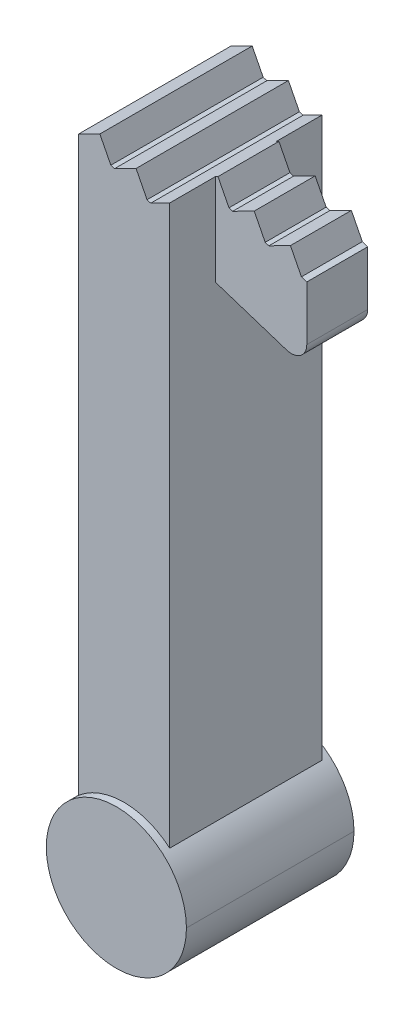
ISO-10303-21;
HEADER;
FILE_DESCRIPTION(('STEP AP214'),'2;1');
FILE_NAME('part.step','',(''),(''),'','','');
FILE_SCHEMA(('AUTOMOTIVE_DESIGN { 1 0 10303 214 1 1 1 1 }'));
ENDSEC;
DATA;
#1=APPLICATION_CONTEXT('core data for automotive mechanical design processes');
#2=APPLICATION_PROTOCOL_DEFINITION('international standard','automotive_design',2000,#1);
#3=PRODUCT_CONTEXT('',#1,'mechanical');
#4=PRODUCT('Part','Part','',(#3));
#5=PRODUCT_RELATED_PRODUCT_CATEGORY('part','',(#4));
#6=PRODUCT_DEFINITION_FORMATION('','',#4);
#7=PRODUCT_DEFINITION_CONTEXT('part definition',#1,'design');
#8=PRODUCT_DEFINITION('design','',#6,#7);
#9=PRODUCT_DEFINITION_SHAPE('','',#8);
#10=(LENGTH_UNIT() NAMED_UNIT(*) SI_UNIT(.MILLI.,.METRE.));
#11=(NAMED_UNIT(*) PLANE_ANGLE_UNIT() SI_UNIT($,.RADIAN.));
#12=(NAMED_UNIT(*) SI_UNIT($,.STERADIAN.) SOLID_ANGLE_UNIT());
#13=UNCERTAINTY_MEASURE_WITH_UNIT(LENGTH_MEASURE(1.E-05),#10,'distance_accuracy_value','');
#14=(GEOMETRIC_REPRESENTATION_CONTEXT(3) GLOBAL_UNCERTAINTY_ASSIGNED_CONTEXT((#13)) GLOBAL_UNIT_ASSIGNED_CONTEXT((#10,
#11,#12)) REPRESENTATION_CONTEXT('',''));
#15=CARTESIAN_POINT('',(0.,0.,0.));
#16=DIRECTION('',(0.,0.,1.));
#17=DIRECTION('',(1.,0.,0.));
#18=AXIS2_PLACEMENT_3D('',#15,#16,#17);
#19=CARTESIAN_POINT('',(-0.74999461407873,10.269587078627,1.25));
#20=DIRECTION('',(1.,0.,0.));
#21=DIRECTION('',(0.,0.,-1.));
#22=AXIS2_PLACEMENT_3D('',#19,#20,#21);
#23=PLANE('',#22);
#24=DIRECTION('',(0.,0.,-1.));
#25=VECTOR('',#24,1.);
#26=CARTESIAN_POINT('',(-0.74999461407873,0.871784422235736,1.375));
#27=LINE('',#26,#25);
#28=CARTESIAN_POINT('',(-0.74999461407873,0.871784422235736,1.25));
#29=VERTEX_POINT('',#28);
#30=CARTESIAN_POINT('',(-0.74999461407873,0.871784422235736,-1.25));
#31=VERTEX_POINT('',#30);
#32=EDGE_CURVE('E11',#29,#31,#27,.T.);
#33=ORIENTED_EDGE('',*,*,#32,.F.);
#34=DIRECTION('',(0.,-1.,0.));
#35=VECTOR('',#34,1.);
#36=CARTESIAN_POINT('',(-0.74999461407873,10.269587078627,1.25));
#37=LINE('',#36,#35);
#38=CARTESIAN_POINT('',(-0.74999461407873,10.269587078627,1.25));
#39=VERTEX_POINT('',#38);
#40=EDGE_CURVE('E25',#39,#29,#37,.T.);
#41=ORIENTED_EDGE('',*,*,#40,.F.);
#42=DIRECTION('',(0.,0.,-1.));
#43=VECTOR('',#42,1.);
#44=CARTESIAN_POINT('',(-0.74999461407873,10.269587078627,1.25));
#45=LINE('',#44,#43);
#46=CARTESIAN_POINT('',(-0.74999461407873,10.269587078627,-1.25));
#47=VERTEX_POINT('',#46);
#48=EDGE_CURVE('E514',#39,#47,#45,.T.);
#49=ORIENTED_EDGE('',*,*,#48,.T.);
#50=DIRECTION('',(0.,-1.,0.));
#51=VECTOR('',#50,1.);
#52=CARTESIAN_POINT('',(-0.74999461407873,10.269587078627,-1.25));
#53=LINE('',#52,#51);
#54=EDGE_CURVE('E510',#47,#31,#53,.T.);
#55=ORIENTED_EDGE('',*,*,#54,.T.);
#56=EDGE_LOOP('',(#33,#41,#49,#55));
#57=FACE_BOUND('',#56,.T.);
#58=ADVANCED_FACE('F17',(#57),#23,.F.);
#59=CARTESIAN_POINT('',(1.99600503402994,8.40399979157656,-1.25));
#60=DIRECTION('',(0.,0.,1.));
#61=DIRECTION('',(1.,0.,0.));
#62=AXIS2_PLACEMENT_3D('',#59,#60,#61);
#63=PLANE('',#62);
#64=CARTESIAN_POINT('',(0.,0.,-1.25));
#65=DIRECTION('',(0.,0.,1.));
#66=DIRECTION('',(1.,0.,0.));
#67=AXIS2_PLACEMENT_3D('',#64,#65,#66);
#68=CIRCLE('',#67,1.15);
#69=CARTESIAN_POINT('',(0.75000502407873,0.871775466422784,-1.25));
#70=VERTEX_POINT('',#69);
#71=EDGE_CURVE('E505',#70,#31,#68,.T.);
#72=ORIENTED_EDGE('',*,*,#71,.T.);
#73=ORIENTED_EDGE('',*,*,#54,.F.);
#74=DIRECTION('',(-0.891006519929732,-0.45399050809759,0.));
#75=VECTOR('',#74,1.);
#76=CARTESIAN_POINT('',(-0.39591414251194,10.450000094243,-1.25));
#77=LINE('',#76,#75);
#78=CARTESIAN_POINT('',(-0.39591414251194,10.450000094243,-1.25));
#79=VERTEX_POINT('',#78);
#80=EDGE_CURVE('E500',#79,#47,#77,.T.);
#81=ORIENTED_EDGE('',*,*,#80,.F.);
#82=DIRECTION('',(-0.453990528946277,0.891006509306795,0.));
#83=VECTOR('',#82,1.);
#84=CARTESIAN_POINT('',(-0.21550111665998,10.095919623069,-1.25));
#85=LINE('',#84,#83);
#86=CARTESIAN_POINT('',(-0.21550111665998,10.095919623069,-1.25));
#87=VERTEX_POINT('',#86);
#88=EDGE_CURVE('E495',#87,#79,#85,.T.);
#89=ORIENTED_EDGE('',*,*,#88,.F.);
#90=DIRECTION('',(-0.951055287303401,0.30902077679704,0.));
#91=VECTOR('',#90,1.);
#92=CARTESIAN_POINT('',(-0.15558447497887,10.076451262604,-1.25));
#93=LINE('',#92,#91);
#94=CARTESIAN_POINT('',(-0.15558447497887,10.076451262604,-1.25));
#95=VERTEX_POINT('',#94);
#96=EDGE_CURVE('E490',#95,#87,#93,.T.);
#97=ORIENTED_EDGE('',*,*,#96,.F.);
#98=DIRECTION('',(-0.891006519929738,-0.453990508097579,0.));
#99=VECTOR('',#98,1.);
#100=CARTESIAN_POINT('',(0.19849599658793,10.25686427822,-1.25));
#101=LINE('',#100,#99);
#102=CARTESIAN_POINT('',(0.19849599658793,10.25686427822,-1.25));
#103=VERTEX_POINT('',#102);
#104=EDGE_CURVE('E485',#103,#95,#101,.T.);
#105=ORIENTED_EDGE('',*,*,#104,.F.);
#106=DIRECTION('',(-0.453990508497482,0.891006519725977,0.));
#107=VECTOR('',#106,1.);
#108=CARTESIAN_POINT('',(0.37890901220366,9.9027838070466,-1.25));
#109=LINE('',#108,#107);
#110=CARTESIAN_POINT('',(0.37890901220366,9.9027838070466,-1.25));
#111=VERTEX_POINT('',#110);
#112=EDGE_CURVE('E480',#111,#103,#109,.T.);
#113=ORIENTED_EDGE('',*,*,#112,.F.);
#114=DIRECTION('',(-0.951059578156974,0.309007570774371,0.));
#115=VECTOR('',#114,1.);
#116=CARTESIAN_POINT('',(0.43882565427848,9.8833163662661,-1.25));
#117=LINE('',#116,#115);
#118=CARTESIAN_POINT('',(0.43882565427848,9.8833163662661,-1.25));
#119=VERTEX_POINT('',#118);
#120=EDGE_CURVE('E475',#119,#111,#117,.T.);
#121=ORIENTED_EDGE('',*,*,#120,.F.);
#122=DIRECTION('',(-0.891006509306383,-0.453990528947086,0.));
#123=VECTOR('',#122,1.);
#124=CARTESIAN_POINT('',(0.79290612545157,10.063729392118,-1.25));
#125=LINE('',#124,#123);
#126=CARTESIAN_POINT('',(0.75000502407873,10.0418701873858,-1.25));
#127=VERTEX_POINT('',#126);
#128=EDGE_CURVE('E470',#127,#119,#125,.T.);
#129=ORIENTED_EDGE('',*,*,#128,.F.);
#130=DIRECTION('',(0.,1.,0.));
#131=VECTOR('',#130,1.);
#132=CARTESIAN_POINT('',(0.75000502407873,0.,-1.25));
#133=LINE('',#132,#131);
#134=EDGE_CURVE('E465',#70,#127,#133,.T.);
#135=ORIENTED_EDGE('',*,*,#134,.F.);
#136=EDGE_LOOP('',(#72,#73,#81,#89,#97,#105,#113,#121,#129,#135));
#137=FACE_BOUND('',#136,.T.);
#138=ADVANCED_FACE('F562',(#137),#63,.F.);
#139=CARTESIAN_POINT('',(0.75000502407873,0.,1.25));
#140=DIRECTION('',(-1.,0.,0.));
#141=DIRECTION('',(0.,0.,1.));
#142=AXIS2_PLACEMENT_3D('',#139,#140,#141);
#143=PLANE('',#142);
#144=DIRECTION('',(0.,0.,-1.));
#145=VECTOR('',#144,1.);
#146=CARTESIAN_POINT('',(0.75000502407873,0.871775466422784,1.375));
#147=LINE('',#146,#145);
#148=CARTESIAN_POINT('',(0.75000502407873,0.871775466422784,1.25));
#149=VERTEX_POINT('',#148);
#150=EDGE_CURVE('E460',#149,#70,#147,.T.);
#151=ORIENTED_EDGE('',*,*,#150,.T.);
#152=ORIENTED_EDGE('',*,*,#134,.T.);
#153=DIRECTION('',(0.,0.,1.));
#154=VECTOR('',#153,1.);
#155=CARTESIAN_POINT('',(0.75000502407873,10.0418701873858,1.25));
#156=LINE('',#155,#154);
#157=CARTESIAN_POINT('',(0.75000502407873,10.0418701873858,-0.5));
#158=VERTEX_POINT('',#157);
#159=EDGE_CURVE('E456',#127,#158,#156,.T.);
#160=ORIENTED_EDGE('',*,*,#159,.T.);
#161=DIRECTION('',(0.,-1.,0.));
#162=VECTOR('',#161,1.);
#163=CARTESIAN_POINT('',(0.75000502407873,12.,-0.5));
#164=LINE('',#163,#162);
#165=CARTESIAN_POINT('',(0.75000502407873,8.5417791450538,-0.5));
#166=VERTEX_POINT('',#165);
#167=EDGE_CURVE('E452',#158,#166,#164,.T.);
#168=ORIENTED_EDGE('',*,*,#167,.T.);
#169=DIRECTION('',(0.,0.,-1.));
#170=VECTOR('',#169,1.);
#171=CARTESIAN_POINT('',(0.75000502407873,8.5417791450538,1.25));
#172=LINE('',#171,#170);
#173=CARTESIAN_POINT('',(0.75000502407873,8.5417791450538,0.5));
#174=VERTEX_POINT('',#173);
#175=EDGE_CURVE('E447',#174,#166,#172,.T.);
#176=ORIENTED_EDGE('',*,*,#175,.F.);
#177=DIRECTION('',(0.,1.,0.));
#178=VECTOR('',#177,1.);
#179=CARTESIAN_POINT('',(0.75000502407873,7.,0.5));
#180=LINE('',#179,#178);
#181=CARTESIAN_POINT('',(0.75000502407873,10.0418701873858,0.5));
#182=VERTEX_POINT('',#181);
#183=EDGE_CURVE('E443',#174,#182,#180,.T.);
#184=ORIENTED_EDGE('',*,*,#183,.T.);
#185=DIRECTION('',(0.,0.,1.));
#186=VECTOR('',#185,1.);
#187=CARTESIAN_POINT('',(0.75000502407873,10.0418701873858,1.25));
#188=LINE('',#187,#186);
#189=CARTESIAN_POINT('',(0.75000502407873,10.0418701873858,1.25));
#190=VERTEX_POINT('',#189);
#191=EDGE_CURVE('E439',#182,#190,#188,.T.);
#192=ORIENTED_EDGE('',*,*,#191,.T.);
#193=DIRECTION('',(0.,1.,0.));
#194=VECTOR('',#193,1.);
#195=CARTESIAN_POINT('',(0.75000502407873,0.,1.25));
#196=LINE('',#195,#194);
#197=EDGE_CURVE('E434',#149,#190,#196,.T.);
#198=ORIENTED_EDGE('',*,*,#197,.F.);
#199=EDGE_LOOP('',(#151,#152,#160,#168,#176,#184,#192,#198));
#200=FACE_BOUND('',#199,.T.);
#201=ADVANCED_FACE('F530',(#200),#143,.F.);
#202=CARTESIAN_POINT('',(1.99600503402994,8.40399979157656,1.25));
#203=DIRECTION('',(0.,0.,1.));
#204=DIRECTION('',(1.,0.,0.));
#205=AXIS2_PLACEMENT_3D('',#202,#203,#204);
#206=PLANE('',#205);
#207=ORIENTED_EDGE('',*,*,#40,.T.);
#208=CARTESIAN_POINT('',(0.,0.,1.25));
#209=DIRECTION('',(0.,0.,1.));
#210=DIRECTION('',(1.,0.,0.));
#211=AXIS2_PLACEMENT_3D('',#208,#209,#210);
#212=CIRCLE('',#211,1.15);
#213=EDGE_CURVE('E429',#149,#29,#212,.T.);
#214=ORIENTED_EDGE('',*,*,#213,.F.);
#215=ORIENTED_EDGE('',*,*,#197,.T.);
#216=DIRECTION('',(-0.891006509306383,-0.453990528947086,0.));
#217=VECTOR('',#216,1.);
#218=CARTESIAN_POINT('',(0.79290612545157,10.063729392118,1.25));
#219=LINE('',#218,#217);
#220=CARTESIAN_POINT('',(0.43882565427848,9.8833163662661,1.25));
#221=VERTEX_POINT('',#220);
#222=EDGE_CURVE('E425',#190,#221,#219,.T.);
#223=ORIENTED_EDGE('',*,*,#222,.T.);
#224=DIRECTION('',(-0.951059578156974,0.309007570774371,0.));
#225=VECTOR('',#224,1.);
#226=CARTESIAN_POINT('',(0.43882565427848,9.8833163662661,1.25));
#227=LINE('',#226,#225);
#228=CARTESIAN_POINT('',(0.37890901220366,9.9027838070466,1.25));
#229=VERTEX_POINT('',#228);
#230=EDGE_CURVE('E421',#221,#229,#227,.T.);
#231=ORIENTED_EDGE('',*,*,#230,.T.);
#232=DIRECTION('',(-0.453990508497482,0.891006519725977,0.));
#233=VECTOR('',#232,1.);
#234=CARTESIAN_POINT('',(0.37890901220366,9.9027838070466,1.25));
#235=LINE('',#234,#233);
#236=CARTESIAN_POINT('',(0.19849599658793,10.25686427822,1.25));
#237=VERTEX_POINT('',#236);
#238=EDGE_CURVE('E417',#229,#237,#235,.T.);
#239=ORIENTED_EDGE('',*,*,#238,.T.);
#240=DIRECTION('',(-0.891006519929738,-0.453990508097579,0.));
#241=VECTOR('',#240,1.);
#242=CARTESIAN_POINT('',(0.19849599658793,10.25686427822,1.25));
#243=LINE('',#242,#241);
#244=CARTESIAN_POINT('',(-0.15558447497887,10.076451262604,1.25));
#245=VERTEX_POINT('',#244);
#246=EDGE_CURVE('E413',#237,#245,#243,.T.);
#247=ORIENTED_EDGE('',*,*,#246,.T.);
#248=DIRECTION('',(-0.951055287303401,0.30902077679704,0.));
#249=VECTOR('',#248,1.);
#250=CARTESIAN_POINT('',(-0.15558447497887,10.076451262604,1.25));
#251=LINE('',#250,#249);
#252=CARTESIAN_POINT('',(-0.21550111665998,10.095919623069,1.25));
#253=VERTEX_POINT('',#252);
#254=EDGE_CURVE('E409',#245,#253,#251,.T.);
#255=ORIENTED_EDGE('',*,*,#254,.T.);
#256=DIRECTION('',(-0.453990528946277,0.891006509306795,0.));
#257=VECTOR('',#256,1.);
#258=CARTESIAN_POINT('',(-0.21550111665998,10.095919623069,1.25));
#259=LINE('',#258,#257);
#260=CARTESIAN_POINT('',(-0.39591414251194,10.450000094243,1.25));
#261=VERTEX_POINT('',#260);
#262=EDGE_CURVE('E405',#253,#261,#259,.T.);
#263=ORIENTED_EDGE('',*,*,#262,.T.);
#264=DIRECTION('',(-0.891006519929732,-0.45399050809759,0.));
#265=VECTOR('',#264,1.);
#266=CARTESIAN_POINT('',(-0.39591414251194,10.450000094243,1.25));
#267=LINE('',#266,#265);
#268=EDGE_CURVE('E401',#261,#39,#267,.T.);
#269=ORIENTED_EDGE('',*,*,#268,.T.);
#270=EDGE_LOOP('',(#207,#214,#215,#223,#231,#239,#247,#255,#263,#269));
#271=FACE_BOUND('',#270,.T.);
#272=ADVANCED_FACE('F524',(#271),#206,.T.);
#273=CARTESIAN_POINT('',(-0.39591414251194,10.450000094243,1.25));
#274=DIRECTION('',(0.45399050809759,-0.891006519929732,0.));
#275=DIRECTION('',(0.891006519929732,0.45399050809759,0.));
#276=AXIS2_PLACEMENT_3D('',#273,#274,#275);
#277=PLANE('',#276);
#278=ORIENTED_EDGE('',*,*,#80,.T.);
#279=ORIENTED_EDGE('',*,*,#48,.F.);
#280=ORIENTED_EDGE('',*,*,#268,.F.);
#281=DIRECTION('',(0.,0.,-1.));
#282=VECTOR('',#281,1.);
#283=CARTESIAN_POINT('',(-0.39591414251194,10.450000094243,1.25));
#284=LINE('',#283,#282);
#285=EDGE_CURVE('E396',#261,#79,#284,.T.);
#286=ORIENTED_EDGE('',*,*,#285,.T.);
#287=EDGE_LOOP('',(#278,#279,#280,#286));
#288=FACE_BOUND('',#287,.T.);
#289=ADVANCED_FACE('F559',(#288),#277,.F.);
#290=CARTESIAN_POINT('',(-0.21550111665998,10.095919623069,1.25));
#291=DIRECTION('',(-0.891006509306795,-0.453990528946277,0.));
#292=DIRECTION('',(0.453990528946277,-0.891006509306795,0.));
#293=AXIS2_PLACEMENT_3D('',#290,#291,#292);
#294=PLANE('',#293);
#295=ORIENTED_EDGE('',*,*,#88,.T.);
#296=ORIENTED_EDGE('',*,*,#285,.F.);
#297=ORIENTED_EDGE('',*,*,#262,.F.);
#298=DIRECTION('',(0.,0.,-1.));
#299=VECTOR('',#298,1.);
#300=CARTESIAN_POINT('',(-0.21550111665998,10.095919623069,1.25));
#301=LINE('',#300,#299);
#302=EDGE_CURVE('E391',#253,#87,#301,.T.);
#303=ORIENTED_EDGE('',*,*,#302,.T.);
#304=EDGE_LOOP('',(#295,#296,#297,#303));
#305=FACE_BOUND('',#304,.T.);
#306=ADVANCED_FACE('F556',(#305),#294,.F.);
#307=CARTESIAN_POINT('',(-0.15558447497887,10.076451262604,1.25));
#308=DIRECTION('',(-0.30902077679704,-0.951055287303401,0.));
#309=DIRECTION('',(0.951055287303401,-0.30902077679704,0.));
#310=AXIS2_PLACEMENT_3D('',#307,#308,#309);
#311=PLANE('',#310);
#312=ORIENTED_EDGE('',*,*,#96,.T.);
#313=ORIENTED_EDGE('',*,*,#302,.F.);
#314=ORIENTED_EDGE('',*,*,#254,.F.);
#315=DIRECTION('',(0.,0.,-1.));
#316=VECTOR('',#315,1.);
#317=CARTESIAN_POINT('',(-0.15558447497887,10.076451262604,1.25));
#318=LINE('',#317,#316);
#319=EDGE_CURVE('E386',#245,#95,#318,.T.);
#320=ORIENTED_EDGE('',*,*,#319,.T.);
#321=EDGE_LOOP('',(#312,#313,#314,#320));
#322=FACE_BOUND('',#321,.T.);
#323=ADVANCED_FACE('F554',(#322),#311,.F.);
#324=CARTESIAN_POINT('',(0.19849599658793,10.25686427822,1.25));
#325=DIRECTION('',(0.453990508097579,-0.891006519929738,0.));
#326=DIRECTION('',(0.891006519929738,0.453990508097579,0.));
#327=AXIS2_PLACEMENT_3D('',#324,#325,#326);
#328=PLANE('',#327);
#329=ORIENTED_EDGE('',*,*,#104,.T.);
#330=ORIENTED_EDGE('',*,*,#319,.F.);
#331=ORIENTED_EDGE('',*,*,#246,.F.);
#332=DIRECTION('',(0.,0.,-1.));
#333=VECTOR('',#332,1.);
#334=CARTESIAN_POINT('',(0.19849599658793,10.25686427822,1.25));
#335=LINE('',#334,#333);
#336=EDGE_CURVE('E381',#237,#103,#335,.T.);
#337=ORIENTED_EDGE('',*,*,#336,.T.);
#338=EDGE_LOOP('',(#329,#330,#331,#337));
#339=FACE_BOUND('',#338,.T.);
#340=ADVANCED_FACE('F548',(#339),#328,.F.);
#341=CARTESIAN_POINT('',(0.37890901220366,9.9027838070466,1.25));
#342=DIRECTION('',(-0.891006519725977,-0.453990508497482,0.));
#343=DIRECTION('',(0.453990508497482,-0.891006519725977,0.));
#344=AXIS2_PLACEMENT_3D('',#341,#342,#343);
#345=PLANE('',#344);
#346=ORIENTED_EDGE('',*,*,#112,.T.);
#347=ORIENTED_EDGE('',*,*,#336,.F.);
#348=ORIENTED_EDGE('',*,*,#238,.F.);
#349=DIRECTION('',(0.,0.,-1.));
#350=VECTOR('',#349,1.);
#351=CARTESIAN_POINT('',(0.37890901220366,9.9027838070466,1.25));
#352=LINE('',#351,#350);
#353=EDGE_CURVE('E376',#229,#111,#352,.T.);
#354=ORIENTED_EDGE('',*,*,#353,.T.);
#355=EDGE_LOOP('',(#346,#347,#348,#354));
#356=FACE_BOUND('',#355,.T.);
#357=ADVANCED_FACE('F546',(#356),#345,.F.);
#358=CARTESIAN_POINT('',(0.43882565427848,9.8833163662661,1.25));
#359=DIRECTION('',(-0.309007570774371,-0.951059578156974,0.));
#360=DIRECTION('',(0.951059578156974,-0.309007570774371,0.));
#361=AXIS2_PLACEMENT_3D('',#358,#359,#360);
#362=PLANE('',#361);
#363=ORIENTED_EDGE('',*,*,#120,.T.);
#364=ORIENTED_EDGE('',*,*,#353,.F.);
#365=ORIENTED_EDGE('',*,*,#230,.F.);
#366=DIRECTION('',(0.,0.,-1.));
#367=VECTOR('',#366,1.);
#368=CARTESIAN_POINT('',(0.43882565427848,9.8833163662661,1.25));
#369=LINE('',#368,#367);
#370=EDGE_CURVE('E371',#221,#119,#369,.T.);
#371=ORIENTED_EDGE('',*,*,#370,.T.);
#372=EDGE_LOOP('',(#363,#364,#365,#371));
#373=FACE_BOUND('',#372,.T.);
#374=ADVANCED_FACE('F540',(#373),#362,.F.);
#375=CARTESIAN_POINT('',(0.79290612545157,10.063729392118,1.25));
#376=DIRECTION('',(0.453990528947086,-0.891006509306383,0.));
#377=DIRECTION('',(0.891006509306383,0.453990528947086,0.));
#378=AXIS2_PLACEMENT_3D('',#375,#376,#377);
#379=PLANE('',#378);
#380=DIRECTION('',(0.891006509306383,0.453990528947086,0.));
#381=VECTOR('',#380,1.);
#382=CARTESIAN_POINT('',(0.79290612545157,10.063729392118,-0.5));
#383=LINE('',#382,#381);
#384=CARTESIAN_POINT('',(0.79290612545157,10.063729392118,-0.5));
#385=VERTEX_POINT('',#384);
#386=EDGE_CURVE('E366',#158,#385,#383,.T.);
#387=ORIENTED_EDGE('',*,*,#386,.F.);
#388=ORIENTED_EDGE('',*,*,#159,.F.);
#389=ORIENTED_EDGE('',*,*,#128,.T.);
#390=ORIENTED_EDGE('',*,*,#370,.F.);
#391=ORIENTED_EDGE('',*,*,#222,.F.);
#392=ORIENTED_EDGE('',*,*,#191,.F.);
#393=DIRECTION('',(-0.891006509306383,-0.453990528947086,0.));
#394=VECTOR('',#393,1.);
#395=CARTESIAN_POINT('',(0.79290612545157,10.063729392118,0.5));
#396=LINE('',#395,#394);
#397=CARTESIAN_POINT('',(0.79290612545157,10.063729392118,0.5));
#398=VERTEX_POINT('',#397);
#399=EDGE_CURVE('E361',#398,#182,#396,.T.);
#400=ORIENTED_EDGE('',*,*,#399,.F.);
#401=DIRECTION('',(0.,0.,-1.));
#402=VECTOR('',#401,1.);
#403=CARTESIAN_POINT('',(0.79290612545157,10.063729392118,1.25));
#404=LINE('',#403,#402);
#405=EDGE_CURVE('E357',#398,#385,#404,.T.);
#406=ORIENTED_EDGE('',*,*,#405,.T.);
#407=EDGE_LOOP('',(#387,#388,#389,#390,#391,#392,#400,#406));
#408=FACE_BOUND('',#407,.T.);
#409=ADVANCED_FACE('F538',(#408),#379,.F.);
#410=CARTESIAN_POINT('',(0.97331915130353,9.70964799063,1.25));
#411=DIRECTION('',(-0.891006991810537,-0.453989581978196,0.));
#412=DIRECTION('',(0.453989581978196,-0.891006991810537,0.));
#413=AXIS2_PLACEMENT_3D('',#410,#411,#412);
#414=PLANE('',#413);
#415=DIRECTION('',(0.453989581978196,-0.891006991810537,0.));
#416=VECTOR('',#415,1.);
#417=CARTESIAN_POINT('',(0.97331915130353,9.70964799063,-0.5));
#418=LINE('',#417,#416);
#419=CARTESIAN_POINT('',(0.97331915130353,9.70964799063,-0.5));
#420=VERTEX_POINT('',#419);
#421=EDGE_CURVE('E352',#385,#420,#418,.T.);
#422=ORIENTED_EDGE('',*,*,#421,.F.);
#423=ORIENTED_EDGE('',*,*,#405,.F.);
#424=DIRECTION('',(-0.453989581978196,0.891006991810537,0.));
#425=VECTOR('',#424,1.);
#426=CARTESIAN_POINT('',(0.97331915130353,9.70964799063,0.5));
#427=LINE('',#426,#425);
#428=CARTESIAN_POINT('',(0.97331915130353,9.70964799063,0.5));
#429=VERTEX_POINT('',#428);
#430=EDGE_CURVE('E347',#429,#398,#427,.T.);
#431=ORIENTED_EDGE('',*,*,#430,.F.);
#432=DIRECTION('',(0.,0.,-1.));
#433=VECTOR('',#432,1.);
#434=CARTESIAN_POINT('',(0.97331915130353,9.70964799063,1.25));
#435=LINE('',#434,#433);
#436=EDGE_CURVE('E343',#429,#420,#435,.T.);
#437=ORIENTED_EDGE('',*,*,#436,.T.);
#438=EDGE_LOOP('',(#422,#423,#431,#437));
#439=FACE_BOUND('',#438,.T.);
#440=ADVANCED_FACE('F587',(#439),#414,.F.);
#441=CARTESIAN_POINT('',(1.0332357831421,9.6901805502432,1.25));
#442=DIRECTION('',(-0.309007612872392,-0.951059564478958,0.));
#443=DIRECTION('',(0.951059564478958,-0.309007612872392,0.));
#444=AXIS2_PLACEMENT_3D('',#441,#442,#443);
#445=PLANE('',#444);
#446=DIRECTION('',(0.951059564478958,-0.309007612872392,0.));
#447=VECTOR('',#446,1.);
#448=CARTESIAN_POINT('',(1.0332357831421,9.6901805502432,-0.5));
#449=LINE('',#448,#447);
#450=CARTESIAN_POINT('',(1.0332357831421,9.6901805502432,-0.5));
#451=VERTEX_POINT('',#450);
#452=EDGE_CURVE('E338',#420,#451,#449,.T.);
#453=ORIENTED_EDGE('',*,*,#452,.F.);
#454=ORIENTED_EDGE('',*,*,#436,.F.);
#455=DIRECTION('',(-0.951059564478958,0.309007612872392,0.));
#456=VECTOR('',#455,1.);
#457=CARTESIAN_POINT('',(1.0332357831421,9.6901805502432,0.5));
#458=LINE('',#457,#456);
#459=CARTESIAN_POINT('',(1.0332357831421,9.6901805502432,0.5));
#460=VERTEX_POINT('',#459);
#461=EDGE_CURVE('E333',#460,#429,#458,.T.);
#462=ORIENTED_EDGE('',*,*,#461,.F.);
#463=DIRECTION('',(0.,0.,-1.));
#464=VECTOR('',#463,1.);
#465=CARTESIAN_POINT('',(1.0332357831421,9.6901805502432,1.25));
#466=LINE('',#465,#464);
#467=EDGE_CURVE('E329',#460,#451,#466,.T.);
#468=ORIENTED_EDGE('',*,*,#467,.T.);
#469=EDGE_LOOP('',(#453,#454,#462,#468));
#470=FACE_BOUND('',#469,.T.);
#471=ADVANCED_FACE('F590',(#470),#445,.F.);
#472=CARTESIAN_POINT('',(1.3873162543152,9.8705935757015,1.25));
#473=DIRECTION('',(0.453990528160763,-0.891006509707035,0.));
#474=DIRECTION('',(0.891006509707035,0.453990528160763,0.));
#475=AXIS2_PLACEMENT_3D('',#472,#473,#474);
#476=PLANE('',#475);
#477=DIRECTION('',(0.891006509707034,0.453990528160763,0.));
#478=VECTOR('',#477,1.);
#479=CARTESIAN_POINT('',(1.3873162543152,9.8705935757015,-0.5));
#480=LINE('',#479,#478);
#481=CARTESIAN_POINT('',(1.3873162543152,9.8705935757015,-0.5));
#482=VERTEX_POINT('',#481);
#483=EDGE_CURVE('E324',#451,#482,#480,.T.);
#484=ORIENTED_EDGE('',*,*,#483,.F.);
#485=ORIENTED_EDGE('',*,*,#467,.F.);
#486=DIRECTION('',(-0.891006509707034,-0.453990528160763,0.));
#487=VECTOR('',#486,1.);
#488=CARTESIAN_POINT('',(1.3873162543152,9.8705935757015,0.5));
#489=LINE('',#488,#487);
#490=CARTESIAN_POINT('',(1.3873162543152,9.8705935757015,0.5));
#491=VERTEX_POINT('',#490);
#492=EDGE_CURVE('E319',#491,#460,#489,.T.);
#493=ORIENTED_EDGE('',*,*,#492,.F.);
#494=DIRECTION('',(0.,0.,-1.));
#495=VECTOR('',#494,1.);
#496=CARTESIAN_POINT('',(1.3873162543152,9.8705935757015,1.25));
#497=LINE('',#496,#495);
#498=EDGE_CURVE('E315',#491,#482,#497,.T.);
#499=ORIENTED_EDGE('',*,*,#498,.T.);
#500=EDGE_LOOP('',(#484,#485,#493,#499));
#501=FACE_BOUND('',#500,.T.);
#502=ADVANCED_FACE('F594',(#501),#476,.F.);
#503=CARTESIAN_POINT('',(1.5677302100885,9.5165131045284,1.25));
#504=DIRECTION('',(-0.891005562735288,-0.453992386692522,0.));
#505=DIRECTION('',(0.453992386692522,-0.891005562735288,0.));
#506=AXIS2_PLACEMENT_3D('',#503,#504,#505);
#507=PLANE('',#506);
#508=DIRECTION('',(0.453992386692522,-0.891005562735288,0.));
#509=VECTOR('',#508,1.);
#510=CARTESIAN_POINT('',(1.5677302100885,9.5165131045284,-0.5));
#511=LINE('',#510,#509);
#512=CARTESIAN_POINT('',(1.5677302100885,9.5165131045284,-0.5));
#513=VERTEX_POINT('',#512);
#514=EDGE_CURVE('E310',#482,#513,#511,.T.);
#515=ORIENTED_EDGE('',*,*,#514,.F.);
#516=ORIENTED_EDGE('',*,*,#498,.F.);
#517=DIRECTION('',(-0.453992386692522,0.891005562735288,0.));
#518=VECTOR('',#517,1.);
#519=CARTESIAN_POINT('',(1.5677302100885,9.5165131045284,0.5));
#520=LINE('',#519,#518);
#521=CARTESIAN_POINT('',(1.5677302100885,9.5165131045284,0.5));
#522=VERTEX_POINT('',#521);
#523=EDGE_CURVE('E305',#522,#491,#520,.T.);
#524=ORIENTED_EDGE('',*,*,#523,.F.);
#525=DIRECTION('',(0.,0.,-1.));
#526=VECTOR('',#525,1.);
#527=CARTESIAN_POINT('',(1.5677302100885,9.5165131045284,1.25));
#528=LINE('',#527,#526);
#529=EDGE_CURVE('E301',#522,#513,#528,.T.);
#530=ORIENTED_EDGE('',*,*,#529,.T.);
#531=EDGE_LOOP('',(#515,#516,#524,#530));
#532=FACE_BOUND('',#531,.T.);
#533=ADVANCED_FACE('F598',(#532),#507,.F.);
#534=CARTESIAN_POINT('',(1.627645922242,9.4970447338267,1.25));
#535=DIRECTION('',(-0.309025260073945,-0.951053830567035,0.));
#536=DIRECTION('',(0.951053830567035,-0.309025260073945,0.));
#537=AXIS2_PLACEMENT_3D('',#534,#535,#536);
#538=PLANE('',#537);
#539=DIRECTION('',(0.951053830567035,-0.309025260073945,0.));
#540=VECTOR('',#539,1.);
#541=CARTESIAN_POINT('',(1.627645922242,9.4970447338267,-0.5));
#542=LINE('',#541,#540);
#543=CARTESIAN_POINT('',(1.627645922242,9.4970447338267,-0.5));
#544=VERTEX_POINT('',#543);
#545=EDGE_CURVE('E296',#513,#544,#542,.T.);
#546=ORIENTED_EDGE('',*,*,#545,.F.);
#547=ORIENTED_EDGE('',*,*,#529,.F.);
#548=DIRECTION('',(-0.951053830567035,0.309025260073945,0.));
#549=VECTOR('',#548,1.);
#550=CARTESIAN_POINT('',(1.627645922242,9.4970447338267,0.5));
#551=LINE('',#550,#549);
#552=CARTESIAN_POINT('',(1.627645922242,9.4970447338267,0.5));
#553=VERTEX_POINT('',#552);
#554=EDGE_CURVE('E291',#553,#522,#551,.T.);
#555=ORIENTED_EDGE('',*,*,#554,.F.);
#556=DIRECTION('',(0.,0.,-1.));
#557=VECTOR('',#556,1.);
#558=CARTESIAN_POINT('',(1.627645922242,9.4970447338267,1.25));
#559=LINE('',#558,#557);
#560=EDGE_CURVE('E287',#553,#544,#559,.T.);
#561=ORIENTED_EDGE('',*,*,#560,.T.);
#562=EDGE_LOOP('',(#546,#547,#555,#561));
#563=FACE_BOUND('',#562,.T.);
#564=ADVANCED_FACE('F602',(#563),#538,.F.);
#565=CARTESIAN_POINT('',(1.9817273233364,9.6774577498361,1.25));
#566=DIRECTION('',(0.453989562715909,-0.891007001625137,0.));
#567=DIRECTION('',(0.891007001625137,0.453989562715909,0.));
#568=AXIS2_PLACEMENT_3D('',#565,#566,#567);
#569=PLANE('',#568);
#570=DIRECTION('',(0.891007001625137,0.453989562715909,0.));
#571=VECTOR('',#570,1.);
#572=CARTESIAN_POINT('',(1.9817273233364,9.6774577498361,-0.5));
#573=LINE('',#572,#571);
#574=CARTESIAN_POINT('',(1.9817273233364,9.6774577498361,-0.5));
#575=VERTEX_POINT('',#574);
#576=EDGE_CURVE('E282',#544,#575,#573,.T.);
#577=ORIENTED_EDGE('',*,*,#576,.F.);
#578=ORIENTED_EDGE('',*,*,#560,.F.);
#579=DIRECTION('',(-0.891007001625137,-0.453989562715909,0.));
#580=VECTOR('',#579,1.);
#581=CARTESIAN_POINT('',(1.9817273233364,9.6774577498361,0.5));
#582=LINE('',#581,#580);
#583=CARTESIAN_POINT('',(1.9817273233364,9.6774577498361,0.5));
#584=VERTEX_POINT('',#583);
#585=EDGE_CURVE('E277',#584,#553,#582,.T.);
#586=ORIENTED_EDGE('',*,*,#585,.F.);
#587=DIRECTION('',(0.,0.,-1.));
#588=VECTOR('',#587,1.);
#589=CARTESIAN_POINT('',(1.9817273233364,9.6774577498361,1.25));
#590=LINE('',#589,#588);
#591=EDGE_CURVE('E273',#584,#575,#590,.T.);
#592=ORIENTED_EDGE('',*,*,#591,.T.);
#593=EDGE_LOOP('',(#577,#578,#586,#592));
#594=FACE_BOUND('',#593,.T.);
#595=ADVANCED_FACE('F606',(#594),#569,.F.);
#596=CARTESIAN_POINT('',(2.1621403393458,9.3233772782693,1.25));
#597=DIRECTION('',(-0.891006519529294,-0.453990508883494,0.));
#598=DIRECTION('',(0.453990508883494,-0.891006519529294,0.));
#599=AXIS2_PLACEMENT_3D('',#596,#597,#598);
#600=PLANE('',#599);
#601=DIRECTION('',(0.453990508883494,-0.891006519529294,0.));
#602=VECTOR('',#601,1.);
#603=CARTESIAN_POINT('',(2.1621403393458,9.3233772782693,-0.5));
#604=LINE('',#603,#602);
#605=CARTESIAN_POINT('',(2.1621403393458,9.3233772782693,-0.5));
#606=VERTEX_POINT('',#605);
#607=EDGE_CURVE('E268',#575,#606,#604,.T.);
#608=ORIENTED_EDGE('',*,*,#607,.F.);
#609=ORIENTED_EDGE('',*,*,#591,.F.);
#610=DIRECTION('',(-0.453990508883494,0.891006519529294,0.));
#611=VECTOR('',#610,1.);
#612=CARTESIAN_POINT('',(2.1621403393458,9.3233772782693,0.5));
#613=LINE('',#612,#611);
#614=CARTESIAN_POINT('',(2.1621403393458,9.3233772782693,0.5));
#615=VERTEX_POINT('',#614);
#616=EDGE_CURVE('E263',#615,#584,#613,.T.);
#617=ORIENTED_EDGE('',*,*,#616,.F.);
#618=DIRECTION('',(0.,0.,-1.));
#619=VECTOR('',#618,1.);
#620=CARTESIAN_POINT('',(2.1621403393458,9.3233772782693,1.25));
#621=LINE('',#620,#619);
#622=EDGE_CURVE('E259',#615,#606,#621,.T.);
#623=ORIENTED_EDGE('',*,*,#622,.T.);
#624=EDGE_LOOP('',(#608,#609,#617,#623));
#625=FACE_BOUND('',#624,.T.);
#626=ADVANCED_FACE('F610',(#625),#600,.F.);
#627=CARTESIAN_POINT('',(2.2500050421575,9.2948285175132,1.25));
#628=DIRECTION('',(-0.309014920833893,-0.951057190026984,0.));
#629=DIRECTION('',(0.951057190026984,-0.309014920833893,0.));
#630=AXIS2_PLACEMENT_3D('',#627,#628,#629);
#631=PLANE('',#630);
#632=DIRECTION('',(0.951057190026984,-0.309014920833893,0.));
#633=VECTOR('',#632,1.);
#634=CARTESIAN_POINT('',(2.2500050421575,9.2948285175132,-0.5));
#635=LINE('',#634,#633);
#636=CARTESIAN_POINT('',(2.2500050421575,9.2948285175132,-0.5));
#637=VERTEX_POINT('',#636);
#638=EDGE_CURVE('E254',#606,#637,#635,.T.);
#639=ORIENTED_EDGE('',*,*,#638,.F.);
#640=ORIENTED_EDGE('',*,*,#622,.F.);
#641=DIRECTION('',(-0.951057190026984,0.309014920833893,0.));
#642=VECTOR('',#641,1.);
#643=CARTESIAN_POINT('',(2.2500050421575,9.2948285175132,0.5));
#644=LINE('',#643,#642);
#645=CARTESIAN_POINT('',(2.2500050421575,9.2948285175132,0.5));
#646=VERTEX_POINT('',#645);
#647=EDGE_CURVE('E249',#646,#615,#644,.T.);
#648=ORIENTED_EDGE('',*,*,#647,.F.);
#649=DIRECTION('',(0.,0.,-1.));
#650=VECTOR('',#649,1.);
#651=CARTESIAN_POINT('',(2.2500050421575,9.2948285175132,1.25));
#652=LINE('',#651,#650);
#653=EDGE_CURVE('E245',#646,#637,#652,.T.);
#654=ORIENTED_EDGE('',*,*,#653,.T.);
#655=EDGE_LOOP('',(#639,#640,#648,#654));
#656=FACE_BOUND('',#655,.T.);
#657=ADVANCED_FACE('F614',(#656),#631,.F.);
#658=CARTESIAN_POINT('',(2.2500050421575,8.404000268928,1.25));
#659=DIRECTION('',(-1.,0.,0.));
#660=DIRECTION('',(0.,0.,1.));
#661=AXIS2_PLACEMENT_3D('',#658,#659,#660);
#662=PLANE('',#661);
#663=DIRECTION('',(0.,-1.,0.));
#664=VECTOR('',#663,1.);
#665=CARTESIAN_POINT('',(2.2500050421575,8.404000268928,-0.5));
#666=LINE('',#665,#664);
#667=CARTESIAN_POINT('',(2.2500050421575,8.40400026892371,-0.5));
#668=VERTEX_POINT('',#667);
#669=EDGE_CURVE('E240',#637,#668,#666,.T.);
#670=ORIENTED_EDGE('',*,*,#669,.F.);
#671=ORIENTED_EDGE('',*,*,#653,.F.);
#672=DIRECTION('',(0.,1.,0.));
#673=VECTOR('',#672,1.);
#674=CARTESIAN_POINT('',(2.2500050421575,8.404000268928,0.5));
#675=LINE('',#674,#673);
#676=CARTESIAN_POINT('',(2.2500050421575,8.40400026892371,0.5));
#677=VERTEX_POINT('',#676);
#678=EDGE_CURVE('E235',#677,#646,#675,.T.);
#679=ORIENTED_EDGE('',*,*,#678,.F.);
#680=DIRECTION('',(0.,0.,-1.));
#681=VECTOR('',#680,1.);
#682=CARTESIAN_POINT('',(2.2500050421575,8.40400026892371,1.25));
#683=LINE('',#682,#681);
#684=EDGE_CURVE('E231',#677,#668,#683,.T.);
#685=ORIENTED_EDGE('',*,*,#684,.T.);
#686=EDGE_LOOP('',(#670,#671,#679,#685));
#687=FACE_BOUND('',#686,.T.);
#688=ADVANCED_FACE('F618',(#687),#662,.F.);
#689=CARTESIAN_POINT('',(1.99600503402994,8.40399979157656,1.25));
#690=DIRECTION('',(0.,0.,1.));
#691=DIRECTION('',(-0.587785565215133,0.809016767023235,0.));
#692=AXIS2_PLACEMENT_3D('',#689,#690,#691);
#693=CYLINDRICAL_SURFACE('',#692,0.254000008128004);
#694=CARTESIAN_POINT('',(1.99600503402994,8.40399979157656,-0.5));
#695=DIRECTION('',(0.,0.,-1.));
#696=DIRECTION('',(-1.,0.,0.));
#697=AXIS2_PLACEMENT_3D('',#694,#695,#696);
#698=CIRCLE('',#697,0.254000008128004);
#699=CARTESIAN_POINT('',(1.9175144478372,8.1624315154968,-0.5));
#700=VERTEX_POINT('',#699);
#701=EDGE_CURVE('E226',#668,#700,#698,.T.);
#702=ORIENTED_EDGE('',*,*,#701,.F.);
#703=ORIENTED_EDGE('',*,*,#684,.F.);
#704=CARTESIAN_POINT('',(1.99600503402994,8.40399979157656,0.5));
#705=DIRECTION('',(0.,0.,1.));
#706=DIRECTION('',(1.,0.,0.));
#707=AXIS2_PLACEMENT_3D('',#704,#705,#706);
#708=CIRCLE('',#707,0.254000008128004);
#709=CARTESIAN_POINT('',(1.9175144478372,8.1624315154968,0.5));
#710=VERTEX_POINT('',#709);
#711=EDGE_CURVE('E221',#710,#677,#708,.T.);
#712=ORIENTED_EDGE('',*,*,#711,.F.);
#713=DIRECTION('',(0.,0.,-1.));
#714=VECTOR('',#713,1.);
#715=CARTESIAN_POINT('',(1.9175144478372,8.1624315154968,1.25));
#716=LINE('',#715,#714);
#717=EDGE_CURVE('E217',#710,#700,#716,.T.);
#718=ORIENTED_EDGE('',*,*,#717,.T.);
#719=EDGE_LOOP('',(#702,#703,#712,#718));
#720=FACE_BOUND('',#719,.T.);
#721=ADVANCED_FACE('F622',(#720),#693,.T.);
#722=CARTESIAN_POINT('',(0.75000502407873,8.5417791450538,1.25));
#723=DIRECTION('',(0.309017600213948,0.951056319445916,0.));
#724=DIRECTION('',(-0.951056319445916,0.309017600213948,0.));
#725=AXIS2_PLACEMENT_3D('',#722,#723,#724);
#726=PLANE('',#725);
#727=DIRECTION('',(-0.951056319445916,0.309017600213948,0.));
#728=VECTOR('',#727,1.);
#729=CARTESIAN_POINT('',(0.75000502407873,8.5417791450538,-0.5));
#730=LINE('',#729,#728);
#731=EDGE_CURVE('E206',#700,#166,#730,.T.);
#732=ORIENTED_EDGE('',*,*,#731,.F.);
#733=ORIENTED_EDGE('',*,*,#717,.F.);
#734=DIRECTION('',(0.951056319445916,-0.309017600213948,0.));
#735=VECTOR('',#734,1.);
#736=CARTESIAN_POINT('',(0.75000502407873,8.5417791450538,0.5));
#737=LINE('',#736,#735);
#738=EDGE_CURVE('E203',#174,#710,#737,.T.);
#739=ORIENTED_EDGE('',*,*,#738,.F.);
#740=ORIENTED_EDGE('',*,*,#175,.T.);
#741=EDGE_LOOP('',(#732,#733,#739,#740));
#742=FACE_BOUND('',#741,.T.);
#743=ADVANCED_FACE('F626',(#742),#726,.F.);
#744=CARTESIAN_POINT('',(5.75000502407873,7.,0.5));
#745=DIRECTION('',(0.,0.,1.));
#746=DIRECTION('',(1.,0.,0.));
#747=AXIS2_PLACEMENT_3D('',#744,#745,#746);
#748=PLANE('',#747);
#749=ORIENTED_EDGE('',*,*,#738,.T.);
#750=ORIENTED_EDGE('',*,*,#711,.T.);
#751=ORIENTED_EDGE('',*,*,#678,.T.);
#752=ORIENTED_EDGE('',*,*,#647,.T.);
#753=ORIENTED_EDGE('',*,*,#616,.T.);
#754=ORIENTED_EDGE('',*,*,#585,.T.);
#755=ORIENTED_EDGE('',*,*,#554,.T.);
#756=ORIENTED_EDGE('',*,*,#523,.T.);
#757=ORIENTED_EDGE('',*,*,#492,.T.);
#758=ORIENTED_EDGE('',*,*,#461,.T.);
#759=ORIENTED_EDGE('',*,*,#430,.T.);
#760=ORIENTED_EDGE('',*,*,#399,.T.);
#761=ORIENTED_EDGE('',*,*,#183,.F.);
#762=EDGE_LOOP('',(#749,#750,#751,#752,#753,#754,#755,#756,#757,#758,#759,#760,#761));
#763=FACE_BOUND('',#762,.T.);
#764=ADVANCED_FACE('F630',(#763),#748,.T.);
#765=CARTESIAN_POINT('',(5.75000502407873,12.,-0.5));
#766=DIRECTION('',(0.,0.,-1.));
#767=DIRECTION('',(-1.,0.,0.));
#768=AXIS2_PLACEMENT_3D('',#765,#766,#767);
#769=PLANE('',#768);
#770=ORIENTED_EDGE('',*,*,#731,.T.);
#771=ORIENTED_EDGE('',*,*,#167,.F.);
#772=ORIENTED_EDGE('',*,*,#386,.T.);
#773=ORIENTED_EDGE('',*,*,#421,.T.);
#774=ORIENTED_EDGE('',*,*,#452,.T.);
#775=ORIENTED_EDGE('',*,*,#483,.T.);
#776=ORIENTED_EDGE('',*,*,#514,.T.);
#777=ORIENTED_EDGE('',*,*,#545,.T.);
#778=ORIENTED_EDGE('',*,*,#576,.T.);
#779=ORIENTED_EDGE('',*,*,#607,.T.);
#780=ORIENTED_EDGE('',*,*,#638,.T.);
#781=ORIENTED_EDGE('',*,*,#669,.T.);
#782=ORIENTED_EDGE('',*,*,#701,.T.);
#783=EDGE_LOOP('',(#770,#771,#772,#773,#774,#775,#776,#777,#778,#779,#780,#781,#782));
#784=FACE_BOUND('',#783,.T.);
#785=ADVANCED_FACE('F634',(#784),#769,.T.);
#786=CARTESIAN_POINT('',(0.,0.,1.375));
#787=DIRECTION('',(0.,0.,1.));
#788=DIRECTION('',(0.,-1.,0.));
#789=AXIS2_PLACEMENT_3D('',#786,#787,#788);
#790=CYLINDRICAL_SURFACE('',#789,1.15);
#791=CARTESIAN_POINT('',(0.,0.,1.375));
#792=DIRECTION('',(0.,0.,1.));
#793=DIRECTION('',(1.,0.,0.));
#794=AXIS2_PLACEMENT_3D('',#791,#792,#793);
#795=CIRCLE('',#794,1.15);
#796=CARTESIAN_POINT('',(1.15,0.,1.375));
#797=VERTEX_POINT('',#796);
#798=CARTESIAN_POINT('',(-1.15,0.,1.375));
#799=VERTEX_POINT('',#798);
#800=EDGE_CURVE('E184',#797,#799,#795,.T.);
#801=ORIENTED_EDGE('',*,*,#800,.F.);
#802=CARTESIAN_POINT('',(1.15,0.,-1.375));
#803=DIRECTION('',(0.,0.,1.));
#804=VECTOR('',#803,1.);
#805=LINE('',#802,#804);
#806=CARTESIAN_POINT('',(1.15,0.,-1.375));
#807=VERTEX_POINT('',#806);
#808=EDGE_CURVE('E198',#807,#797,#805,.T.);
#809=ORIENTED_EDGE('',*,*,#808,.F.);
#810=CARTESIAN_POINT('',(0.,0.,-1.375));
#811=DIRECTION('',(0.,0.,1.));
#812=DIRECTION('',(1.,0.,0.));
#813=AXIS2_PLACEMENT_3D('',#810,#811,#812);
#814=CIRCLE('',#813,1.15);
#815=CARTESIAN_POINT('',(-1.15,0.,-1.375));
#816=VERTEX_POINT('',#815);
#817=EDGE_CURVE('E187',#807,#816,#814,.T.);
#818=ORIENTED_EDGE('',*,*,#817,.T.);
#819=CARTESIAN_POINT('',(-1.15,0.,-1.375));
#820=DIRECTION('',(0.,0.,1.));
#821=VECTOR('',#820,1.);
#822=LINE('',#819,#821);
#823=EDGE_CURVE('E178',#816,#799,#822,.T.);
#824=ORIENTED_EDGE('',*,*,#823,.T.);
#825=EDGE_LOOP('',(#801,#809,#818,#824));
#826=FACE_BOUND('',#825,.T.);
#827=ORIENTED_EDGE('',*,*,#213,.T.);
#828=ORIENTED_EDGE('',*,*,#32,.T.);
#829=ORIENTED_EDGE('',*,*,#71,.F.);
#830=ORIENTED_EDGE('',*,*,#150,.F.);
#831=EDGE_LOOP('',(#827,#828,#829,#830));
#832=FACE_BOUND('',#831,.T.);
#833=ADVANCED_FACE('F181',(#826,#832),#790,.T.);
#834=CARTESIAN_POINT('',(0.,0.,1.375));
#835=DIRECTION('',(0.,0.,1.));
#836=DIRECTION('',(0.,1.,0.));
#837=AXIS2_PLACEMENT_3D('',#834,#835,#836);
#838=CYLINDRICAL_SURFACE('',#837,1.15);
#839=CARTESIAN_POINT('',(0.,0.,-1.375));
#840=DIRECTION('',(0.,0.,1.));
#841=DIRECTION('',(1.,0.,0.));
#842=AXIS2_PLACEMENT_3D('',#839,#840,#841);
#843=CIRCLE('',#842,1.15);
#844=EDGE_CURVE('E192',#816,#807,#843,.T.);
#845=ORIENTED_EDGE('',*,*,#844,.T.);
#846=ORIENTED_EDGE('',*,*,#808,.T.);
#847=CARTESIAN_POINT('',(0.,0.,1.375));
#848=DIRECTION('',(0.,0.,1.));
#849=DIRECTION('',(1.,0.,0.));
#850=AXIS2_PLACEMENT_3D('',#847,#848,#849);
#851=CIRCLE('',#850,1.15);
#852=EDGE_CURVE('E196',#799,#797,#851,.T.);
#853=ORIENTED_EDGE('',*,*,#852,.F.);
#854=ORIENTED_EDGE('',*,*,#823,.F.);
#855=EDGE_LOOP('',(#845,#846,#853,#854));
#856=FACE_BOUND('',#855,.T.);
#857=ADVANCED_FACE('F197',(#856),#838,.T.);
#858=CARTESIAN_POINT('',(0.,0.,1.375));
#859=DIRECTION('',(0.,0.,1.));
#860=DIRECTION('',(1.,0.,0.));
#861=AXIS2_PLACEMENT_3D('',#858,#859,#860);
#862=PLANE('',#861);
#863=ORIENTED_EDGE('',*,*,#800,.T.);
#864=ORIENTED_EDGE('',*,*,#852,.T.);
#865=EDGE_LOOP('',(#863,#864));
#866=FACE_BOUND('',#865,.T.);
#867=ADVANCED_FACE('F202',(#866),#862,.T.);
#868=CARTESIAN_POINT('',(0.,0.,-1.375));
#869=DIRECTION('',(0.,0.,1.));
#870=DIRECTION('',(1.,0.,0.));
#871=AXIS2_PLACEMENT_3D('',#868,#869,#870);
#872=PLANE('',#871);
#873=ORIENTED_EDGE('',*,*,#817,.F.);
#874=ORIENTED_EDGE('',*,*,#844,.F.);
#875=EDGE_LOOP('',(#873,#874));
#876=FACE_BOUND('',#875,.T.);
#877=ADVANCED_FACE('F677',(#876),#872,.F.);
#878=CLOSED_SHELL('',(#58,#138,#201,#272,#289,#306,#323,#340,#357,#374,#409,#440,#471,#502,#533,
#564,#595,#626,#657,#688,#721,#743,#764,#785,#833,#857,#867,#877));
#879=MANIFOLD_SOLID_BREP('B1',#878);
#880=ADVANCED_BREP_SHAPE_REPRESENTATION('',(#18,#879),#14);
#881=SHAPE_DEFINITION_REPRESENTATION(#9,#880);
ENDSEC;
END-ISO-10303-21;
